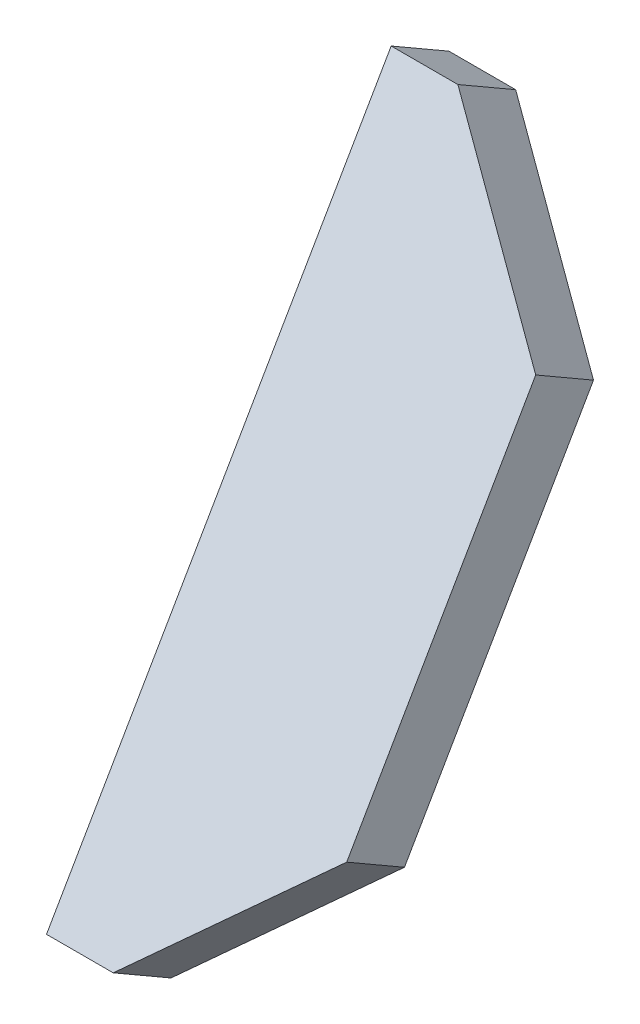
ISO-10303-21;
HEADER;
FILE_DESCRIPTION(('STEP AP214'),'2;1');
FILE_NAME('part.step','',(''),(''),'','','');
FILE_SCHEMA(('AUTOMOTIVE_DESIGN { 1 0 10303 214 1 1 1 1 }'));
ENDSEC;
DATA;
#1=APPLICATION_CONTEXT('core data for automotive mechanical design processes');
#2=APPLICATION_PROTOCOL_DEFINITION('international standard','automotive_design',2000,#1);
#3=PRODUCT_CONTEXT('',#1,'mechanical');
#4=PRODUCT('Part','Part','',(#3));
#5=PRODUCT_RELATED_PRODUCT_CATEGORY('part','',(#4));
#6=PRODUCT_DEFINITION_FORMATION('','',#4);
#7=PRODUCT_DEFINITION_CONTEXT('part definition',#1,'design');
#8=PRODUCT_DEFINITION('design','',#6,#7);
#9=PRODUCT_DEFINITION_SHAPE('','',#8);
#10=(LENGTH_UNIT() NAMED_UNIT(*) SI_UNIT(.MILLI.,.METRE.));
#11=(NAMED_UNIT(*) PLANE_ANGLE_UNIT() SI_UNIT($,.RADIAN.));
#12=(NAMED_UNIT(*) SI_UNIT($,.STERADIAN.) SOLID_ANGLE_UNIT());
#13=UNCERTAINTY_MEASURE_WITH_UNIT(LENGTH_MEASURE(1.E-05),#10,'distance_accuracy_value','');
#14=(GEOMETRIC_REPRESENTATION_CONTEXT(3) GLOBAL_UNCERTAINTY_ASSIGNED_CONTEXT((#13)) GLOBAL_UNIT_ASSIGNED_CONTEXT((#10,
#11,#12)) REPRESENTATION_CONTEXT('',''));
#15=CARTESIAN_POINT('',(0.,0.,0.));
#16=DIRECTION('',(0.,0.,1.));
#17=DIRECTION('',(1.,0.,0.));
#18=AXIS2_PLACEMENT_3D('',#15,#16,#17);
#19=CARTESIAN_POINT('',(76.5,35.0323776072813,13.8432667397366));
#20=DIRECTION('',(0.,0.5,0.866025403784439));
#21=DIRECTION('',(0.,-0.866025403784439,0.5));
#22=AXIS2_PLACEMENT_3D('',#19,#20,#21);
#23=PLANE('',#22);
#24=DIRECTION('',(-0.707106781186548,-0.612372435695792,0.353553390593277));
#25=VECTOR('',#24,1.);
#26=CARTESIAN_POINT('',(81.5,27.6711616751135,18.0932667397366));
#27=LINE('',#26,#25);
#28=CARTESIAN_POINT('',(81.5,27.6711616751135,18.0932667397366));
#29=VERTEX_POINT('',#28);
#30=CARTESIAN_POINT('',(74.5,21.6089838486225,21.5932667397366));
#31=VERTEX_POINT('',#30);
#32=EDGE_CURVE('E71',#29,#31,#27,.T.);
#33=ORIENTED_EDGE('',*,*,#32,.F.);
#34=DIRECTION('',(0.,-0.866025403784439,0.499999999999999));
#35=VECTOR('',#34,1.);
#36=CARTESIAN_POINT('',(81.5,42.393593539449,9.5932667397366));
#37=LINE('',#36,#35);
#38=CARTESIAN_POINT('',(81.5,42.393593539449,9.59326673973661));
#39=VERTEX_POINT('',#38);
#40=EDGE_CURVE('E66',#39,#29,#37,.T.);
#41=ORIENTED_EDGE('',*,*,#40,.F.);
#42=DIRECTION('',(0.707106781186548,-0.612372435695795,0.353553390593273));
#43=VECTOR('',#42,1.);
#44=CARTESIAN_POINT('',(74.5,48.4557713659401,6.09326673973661));
#45=LINE('',#44,#43);
#46=CARTESIAN_POINT('',(74.5,48.4557713659401,6.09326673973661));
#47=VERTEX_POINT('',#46);
#48=EDGE_CURVE('E93',#47,#39,#45,.T.);
#49=ORIENTED_EDGE('',*,*,#48,.F.);
#50=DIRECTION('',(1.,0.,0.));
#51=VECTOR('',#50,1.);
#52=CARTESIAN_POINT('',(81.5,48.4557713659401,6.0932667397366));
#53=LINE('',#52,#51);
#54=CARTESIAN_POINT('',(71.5,48.4557713659401,6.0932667397366));
#55=VERTEX_POINT('',#54);
#56=EDGE_CURVE('E99',#55,#47,#53,.T.);
#57=ORIENTED_EDGE('',*,*,#56,.F.);
#58=DIRECTION('',(0.,-0.866025403784439,0.5));
#59=VECTOR('',#58,1.);
#60=CARTESIAN_POINT('',(71.5,48.4557713659401,6.0932667397366));
#61=LINE('',#60,#59);
#62=CARTESIAN_POINT('',(71.5,21.6089838486225,21.5932667397366));
#63=VERTEX_POINT('',#62);
#64=EDGE_CURVE('E82',#55,#63,#61,.T.);
#65=ORIENTED_EDGE('',*,*,#64,.T.);
#66=DIRECTION('',(1.,0.,0.));
#67=VECTOR('',#66,1.);
#68=CARTESIAN_POINT('',(71.5,21.6089838486225,21.5932667397366));
#69=LINE('',#68,#67);
#70=EDGE_CURVE('E20',#31,#63,#69,.F.);
#71=ORIENTED_EDGE('',*,*,#70,.F.);
#72=EDGE_LOOP('',(#33,#41,#49,#57,#65,#71));
#73=FACE_BOUND('',#72,.T.);
#74=ADVANCED_FACE('F17',(#73),#23,.T.);
#75=CARTESIAN_POINT('',(71.5,20.1089838486225,18.9951905283833));
#76=DIRECTION('',(0.,-0.866025403784439,0.5));
#77=DIRECTION('',(0.,-0.5,-0.866025403784439));
#78=AXIS2_PLACEMENT_3D('',#75,#76,#77);
#79=PLANE('',#78);
#80=DIRECTION('',(0.,-0.500000000000002,-0.866025403784437));
#81=VECTOR('',#80,1.);
#82=CARTESIAN_POINT('',(71.5,21.6089838486225,21.5932667397366));
#83=LINE('',#82,#81);
#84=CARTESIAN_POINT('',(71.5,20.1089838486225,18.9951905283833));
#85=VERTEX_POINT('',#84);
#86=EDGE_CURVE('E103',#63,#85,#83,.T.);
#87=ORIENTED_EDGE('',*,*,#86,.T.);
#88=DIRECTION('',(1.,0.,0.));
#89=VECTOR('',#88,1.);
#90=CARTESIAN_POINT('',(52.8749999999999,20.1089838486225,18.9951905283833));
#91=LINE('',#90,#89);
#92=CARTESIAN_POINT('',(74.5,20.1089838486225,18.9951905283833));
#93=VERTEX_POINT('',#92);
#94=EDGE_CURVE('E88',#85,#93,#91,.T.);
#95=ORIENTED_EDGE('',*,*,#94,.T.);
#96=DIRECTION('',(0.,-0.500000000000003,-0.866025403784437));
#97=VECTOR('',#96,1.);
#98=CARTESIAN_POINT('',(74.5,21.6089838486225,21.5932667397366));
#99=LINE('',#98,#97);
#100=EDGE_CURVE('E76',#31,#93,#99,.T.);
#101=ORIENTED_EDGE('',*,*,#100,.F.);
#102=ORIENTED_EDGE('',*,*,#70,.T.);
#103=EDGE_LOOP('',(#87,#95,#101,#102));
#104=FACE_BOUND('',#103,.T.);
#105=ADVANCED_FACE('F87',(#104),#79,.T.);
#106=CARTESIAN_POINT('',(78.,23.140072761868,17.2451905283833));
#107=DIRECTION('',(0.707106781186547,-0.612372435695795,0.353553390593274));
#108=DIRECTION('',(0.654653670707977,0.755928946018454,0.));
#109=AXIS2_PLACEMENT_3D('',#106,#107,#108);
#110=PLANE('',#109);
#111=DIRECTION('',(0.707106781186551,0.612372435695792,-0.353553390593272));
#112=VECTOR('',#111,1.);
#113=CARTESIAN_POINT('',(74.5,20.1089838486225,18.9951905283833));
#114=LINE('',#113,#112);
#115=CARTESIAN_POINT('',(81.5,26.1711616751135,15.4951905283833));
#116=VERTEX_POINT('',#115);
#117=EDGE_CURVE('E107',#93,#116,#114,.T.);
#118=ORIENTED_EDGE('',*,*,#117,.T.);
#119=DIRECTION('',(0.,-0.500000000000003,-0.866025403784437));
#120=VECTOR('',#119,1.);
#121=CARTESIAN_POINT('',(81.5,27.6711616751135,18.0932667397366));
#122=LINE('',#121,#120);
#123=EDGE_CURVE('E78',#29,#116,#122,.T.);
#124=ORIENTED_EDGE('',*,*,#123,.F.);
#125=ORIENTED_EDGE('',*,*,#32,.T.);
#126=ORIENTED_EDGE('',*,*,#100,.T.);
#127=EDGE_LOOP('',(#118,#124,#125,#126));
#128=FACE_BOUND('',#127,.T.);
#129=ADVANCED_FACE('F74',(#128),#110,.T.);
#130=CARTESIAN_POINT('',(81.5,20.1089838486225,18.9951905283833));
#131=DIRECTION('',(1.,0.,0.));
#132=DIRECTION('',(0.,0.,-1.));
#133=AXIS2_PLACEMENT_3D('',#130,#131,#132);
#134=PLANE('',#133);
#135=ORIENTED_EDGE('',*,*,#123,.T.);
#136=DIRECTION('',(0.,-0.866025403784439,0.5));
#137=VECTOR('',#136,1.);
#138=CARTESIAN_POINT('',(81.5,29.8442066707183,13.3745570114253));
#139=LINE('',#138,#137);
#140=CARTESIAN_POINT('',(81.5,40.893593539449,6.99519052838329));
#141=VERTEX_POINT('',#140);
#142=EDGE_CURVE('E109',#116,#141,#139,.F.);
#143=ORIENTED_EDGE('',*,*,#142,.T.);
#144=DIRECTION('',(0.,-0.5,-0.866025403784439));
#145=VECTOR('',#144,1.);
#146=CARTESIAN_POINT('',(81.5,42.393593539449,9.59326673973661));
#147=LINE('',#146,#145);
#148=EDGE_CURVE('E95',#39,#141,#147,.T.);
#149=ORIENTED_EDGE('',*,*,#148,.F.);
#150=ORIENTED_EDGE('',*,*,#40,.T.);
#151=EDGE_LOOP('',(#135,#143,#149,#150));
#152=FACE_BOUND('',#151,.T.);
#153=ADVANCED_FACE('F126',(#152),#134,.T.);
#154=CARTESIAN_POINT('',(78.,43.9246824526945,5.24519052838328));
#155=DIRECTION('',(0.707106781186548,0.612372435695794,-0.353553390593274));
#156=DIRECTION('',(-0.654653670707977,0.755928946018455,0.));
#157=AXIS2_PLACEMENT_3D('',#154,#155,#156);
#158=PLANE('',#157);
#159=DIRECTION('',(-0.707106781186546,0.612372435695796,-0.353553390593274));
#160=VECTOR('',#159,1.);
#161=CARTESIAN_POINT('',(81.5,40.893593539449,6.99519052838331));
#162=LINE('',#161,#160);
#163=CARTESIAN_POINT('',(74.5,46.9557713659401,3.49519052838329));
#164=VERTEX_POINT('',#163);
#165=EDGE_CURVE('E112',#141,#164,#162,.T.);
#166=ORIENTED_EDGE('',*,*,#165,.T.);
#167=DIRECTION('',(0.,0.5,0.866025403784439));
#168=VECTOR('',#167,1.);
#169=CARTESIAN_POINT('',(74.5,46.9557713659401,3.49519052838328));
#170=LINE('',#169,#168);
#171=EDGE_CURVE('E97',#47,#164,#170,.F.);
#172=ORIENTED_EDGE('',*,*,#171,.F.);
#173=ORIENTED_EDGE('',*,*,#48,.T.);
#174=ORIENTED_EDGE('',*,*,#148,.T.);
#175=EDGE_LOOP('',(#166,#172,#173,#174));
#176=FACE_BOUND('',#175,.T.);
#177=ADVANCED_FACE('F125',(#176),#158,.T.);
#178=CARTESIAN_POINT('',(81.5,46.9557713659401,3.49519052838328));
#179=DIRECTION('',(0.,0.866025403784439,-0.5));
#180=DIRECTION('',(0.,0.5,0.866025403784439));
#181=AXIS2_PLACEMENT_3D('',#178,#179,#180);
#182=PLANE('',#181);
#183=DIRECTION('',(0.,0.499999999999998,0.86602540378444));
#184=VECTOR('',#183,1.);
#185=CARTESIAN_POINT('',(71.5,46.9557713659401,3.49519052838328));
#186=LINE('',#185,#184);
#187=CARTESIAN_POINT('',(71.5,46.9557713659401,3.49519052838328));
#188=VERTEX_POINT('',#187);
#189=EDGE_CURVE('E34',#188,#55,#186,.T.);
#190=ORIENTED_EDGE('',*,*,#189,.T.);
#191=ORIENTED_EDGE('',*,*,#56,.T.);
#192=ORIENTED_EDGE('',*,*,#171,.T.);
#193=DIRECTION('',(1.,0.,0.));
#194=VECTOR('',#193,1.);
#195=CARTESIAN_POINT('',(52.8749999999999,46.9557713659401,3.49519052838329));
#196=LINE('',#195,#194);
#197=EDGE_CURVE('E26',#164,#188,#196,.F.);
#198=ORIENTED_EDGE('',*,*,#197,.T.);
#199=EDGE_LOOP('',(#190,#191,#192,#198));
#200=FACE_BOUND('',#199,.T.);
#201=ADVANCED_FACE('F118',(#200),#182,.T.);
#202=CARTESIAN_POINT('',(71.5,32.261096315171,15.4432667397367));
#203=DIRECTION('',(1.,0.,0.));
#204=DIRECTION('',(0.,1.,0.));
#205=AXIS2_PLACEMENT_3D('',#202,#203,#204);
#206=PLANE('',#205);
#207=DIRECTION('',(0.,-0.866025403784439,0.5));
#208=VECTOR('',#207,1.);
#209=CARTESIAN_POINT('',(71.5,29.8442066707183,13.3745570114253));
#210=LINE('',#209,#208);
#211=EDGE_CURVE('E11',#188,#85,#210,.T.);
#212=ORIENTED_EDGE('',*,*,#211,.T.);
#213=ORIENTED_EDGE('',*,*,#86,.F.);
#214=ORIENTED_EDGE('',*,*,#64,.F.);
#215=ORIENTED_EDGE('',*,*,#189,.F.);
#216=EDGE_LOOP('',(#212,#213,#214,#215));
#217=FACE_BOUND('',#216,.T.);
#218=ADVANCED_FACE('F127',(#217),#206,.F.);
#219=CARTESIAN_POINT('',(52.8749999999999,29.8442066707183,13.3745570114253));
#220=DIRECTION('',(0.,0.5,0.866025403784439));
#221=DIRECTION('',(0.,-0.866025403784439,0.5));
#222=AXIS2_PLACEMENT_3D('',#219,#220,#221);
#223=PLANE('',#222);
#224=ORIENTED_EDGE('',*,*,#197,.F.);
#225=ORIENTED_EDGE('',*,*,#165,.F.);
#226=ORIENTED_EDGE('',*,*,#142,.F.);
#227=ORIENTED_EDGE('',*,*,#117,.F.);
#228=ORIENTED_EDGE('',*,*,#94,.F.);
#229=ORIENTED_EDGE('',*,*,#211,.F.);
#230=EDGE_LOOP('',(#224,#225,#226,#227,#228,#229));
#231=FACE_BOUND('',#230,.T.);
#232=ADVANCED_FACE('F122',(#231),#223,.F.);
#233=CLOSED_SHELL('',(#74,#105,#129,#153,#177,#201,#218,#232));
#234=MANIFOLD_SOLID_BREP('B1',#233);
#235=ADVANCED_BREP_SHAPE_REPRESENTATION('',(#18,#234),#14);
#236=SHAPE_DEFINITION_REPRESENTATION(#9,#235);
ENDSEC;
END-ISO-10303-21;
